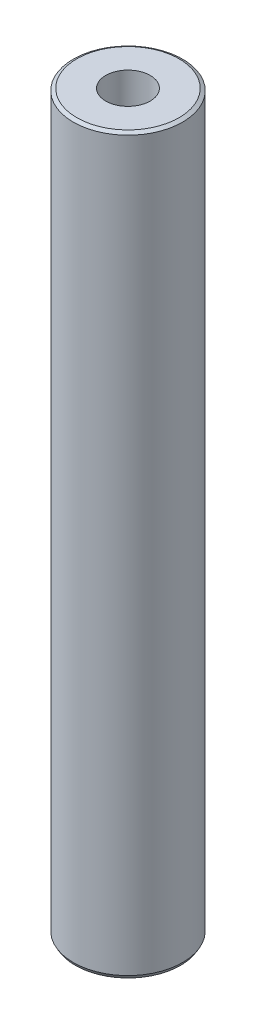
ISO-10303-21;
HEADER;
FILE_DESCRIPTION(('STEP AP214'),'2;1');
FILE_NAME('part.step','',(''),(''),'','','');
FILE_SCHEMA(('AUTOMOTIVE_DESIGN { 1 0 10303 214 1 1 1 1 }'));
ENDSEC;
DATA;
#1=APPLICATION_CONTEXT('core data for automotive mechanical design processes');
#2=APPLICATION_PROTOCOL_DEFINITION('international standard','automotive_design',2000,#1);
#3=PRODUCT_CONTEXT('',#1,'mechanical');
#4=PRODUCT('Part','Part','',(#3));
#5=PRODUCT_RELATED_PRODUCT_CATEGORY('part','',(#4));
#6=PRODUCT_DEFINITION_FORMATION('','',#4);
#7=PRODUCT_DEFINITION_CONTEXT('part definition',#1,'design');
#8=PRODUCT_DEFINITION('design','',#6,#7);
#9=PRODUCT_DEFINITION_SHAPE('','',#8);
#10=(LENGTH_UNIT() NAMED_UNIT(*) SI_UNIT(.MILLI.,.METRE.));
#11=(NAMED_UNIT(*) PLANE_ANGLE_UNIT() SI_UNIT($,.RADIAN.));
#12=(NAMED_UNIT(*) SI_UNIT($,.STERADIAN.) SOLID_ANGLE_UNIT());
#13=UNCERTAINTY_MEASURE_WITH_UNIT(LENGTH_MEASURE(1.E-05),#10,'distance_accuracy_value','');
#14=(GEOMETRIC_REPRESENTATION_CONTEXT(3) GLOBAL_UNCERTAINTY_ASSIGNED_CONTEXT((#13)) GLOBAL_UNIT_ASSIGNED_CONTEXT((#10,
#11,#12)) REPRESENTATION_CONTEXT('',''));
#15=CARTESIAN_POINT('',(0.,0.,0.));
#16=DIRECTION('',(0.,0.,1.));
#17=DIRECTION('',(1.,0.,0.));
#18=AXIS2_PLACEMENT_3D('',#15,#16,#17);
#19=CARTESIAN_POINT('',(0.,436.254081007214,0.));
#20=DIRECTION('',(0.,-1.,0.));
#21=DIRECTION('',(0.,0.,-1.));
#22=AXIS2_PLACEMENT_3D('',#19,#20,#21);
#23=CYLINDRICAL_SURFACE('',#22,32.5);
#24=CARTESIAN_POINT('',(0.,435.037041553271,0.));
#25=DIRECTION('',(0.,1.,0.));
#26=DIRECTION('',(0.,0.,1.));
#27=AXIS2_PLACEMENT_3D('',#24,#25,#26);
#28=CIRCLE('',#27,32.5);
#29=CARTESIAN_POINT('',(0.,435.037041553271,32.5));
#30=VERTEX_POINT('',#29);
#31=EDGE_CURVE('E50',#30,#30,#28,.F.);
#32=ORIENTED_EDGE('',*,*,#31,.T.);
#33=EDGE_LOOP('',(#32));
#34=FACE_BOUND('',#33,.T.);
#35=CARTESIAN_POINT('',(0.,2.10797416904568,0.));
#36=DIRECTION('',(0.,1.,0.));
#37=DIRECTION('',(0.,0.,1.));
#38=AXIS2_PLACEMENT_3D('',#35,#36,#37);
#39=CIRCLE('',#38,32.5);
#40=CARTESIAN_POINT('',(0.,2.10797416904568,32.5));
#41=VERTEX_POINT('',#40);
#42=EDGE_CURVE('E51',#41,#41,#39,.T.);
#43=ORIENTED_EDGE('',*,*,#42,.T.);
#44=EDGE_LOOP('',(#43));
#45=FACE_BOUND('',#44,.T.);
#46=ADVANCED_FACE('F39',(#34,#45),#23,.T.);
#47=CARTESIAN_POINT('',(0.,436.254081007214,0.));
#48=DIRECTION('',(0.,1.,0.));
#49=DIRECTION('',(0.,0.,1.));
#50=AXIS2_PLACEMENT_3D('',#47,#48,#49);
#51=PLANE('',#50);
#52=CARTESIAN_POINT('',(0.,436.254081007214,0.));
#53=DIRECTION('',(0.,1.,0.));
#54=DIRECTION('',(0.,0.,1.));
#55=AXIS2_PLACEMENT_3D('',#52,#53,#54);
#56=CIRCLE('',#55,30.3920258309543);
#57=CARTESIAN_POINT('',(0.,436.254081007214,30.3920258309543));
#58=VERTEX_POINT('',#57);
#59=EDGE_CURVE('E54',#58,#58,#56,.T.);
#60=ORIENTED_EDGE('',*,*,#59,.T.);
#61=EDGE_LOOP('',(#60));
#62=FACE_BOUND('',#61,.T.);
#63=CARTESIAN_POINT('',(0.,436.254081007214,0.));
#64=DIRECTION('',(0.,1.,0.));
#65=DIRECTION('',(0.,0.,1.));
#66=AXIS2_PLACEMENT_3D('',#63,#64,#65);
#67=CIRCLE('',#66,13.2352410158458);
#68=CARTESIAN_POINT('',(0.,436.254081007214,13.2352410158458));
#69=VERTEX_POINT('',#68);
#70=EDGE_CURVE('E58',#69,#69,#67,.T.);
#71=ORIENTED_EDGE('',*,*,#70,.F.);
#72=EDGE_LOOP('',(#71));
#73=FACE_BOUND('',#72,.T.);
#74=ADVANCED_FACE('F69',(#62,#73),#51,.T.);
#75=CARTESIAN_POINT('',(0.,0.,0.));
#76=DIRECTION('',(0.,1.,0.));
#77=DIRECTION('',(0.,0.,1.));
#78=AXIS2_PLACEMENT_3D('',#75,#76,#77);
#79=PLANE('',#78);
#80=CARTESIAN_POINT('',(0.,0.,0.));
#81=DIRECTION('',(0.,1.,0.));
#82=DIRECTION('',(0.,0.,1.));
#83=AXIS2_PLACEMENT_3D('',#80,#81,#82);
#84=CIRCLE('',#83,31.2829605460567);
#85=CARTESIAN_POINT('',(0.,0.,31.2829605460567));
#86=VERTEX_POINT('',#85);
#87=EDGE_CURVE('E10',#86,#86,#84,.F.);
#88=ORIENTED_EDGE('',*,*,#87,.T.);
#89=EDGE_LOOP('',(#88));
#90=FACE_BOUND('',#89,.T.);
#91=CARTESIAN_POINT('',(0.,0.,0.));
#92=DIRECTION('',(0.,1.,0.));
#93=DIRECTION('',(0.,0.,1.));
#94=AXIS2_PLACEMENT_3D('',#91,#92,#93);
#95=CIRCLE('',#94,13.2352410158458);
#96=CARTESIAN_POINT('',(0.,0.,13.2352410158458));
#97=VERTEX_POINT('',#96);
#98=EDGE_CURVE('E63',#97,#97,#95,.T.);
#99=ORIENTED_EDGE('',*,*,#98,.T.);
#100=EDGE_LOOP('',(#99));
#101=FACE_BOUND('',#100,.T.);
#102=ADVANCED_FACE('F75',(#90,#101),#79,.F.);
#103=CARTESIAN_POINT('',(0.,436.254081007214,0.));
#104=DIRECTION('',(0.,-1.,0.));
#105=DIRECTION('',(0.,0.,-1.));
#106=AXIS2_PLACEMENT_3D('',#103,#104,#105);
#107=CYLINDRICAL_SURFACE('',#106,13.2352410158458);
#108=ORIENTED_EDGE('',*,*,#70,.T.);
#109=EDGE_LOOP('',(#108));
#110=FACE_BOUND('',#109,.T.);
#111=ORIENTED_EDGE('',*,*,#98,.F.);
#112=EDGE_LOOP('',(#111));
#113=FACE_BOUND('',#112,.T.);
#114=ADVANCED_FACE('F70',(#110,#113),#107,.F.);
#115=CARTESIAN_POINT('',(0.,436.254081007214,0.));
#116=DIRECTION('',(0.,-1.,0.));
#117=DIRECTION('',(0.,0.,-1.));
#118=AXIS2_PLACEMENT_3D('',#115,#116,#117);
#119=CONICAL_SURFACE('',#118,30.3920258309543,1.04719755119658);
#120=ORIENTED_EDGE('',*,*,#31,.F.);
#121=EDGE_LOOP('',(#120));
#122=FACE_BOUND('',#121,.T.);
#123=ORIENTED_EDGE('',*,*,#59,.F.);
#124=EDGE_LOOP('',(#123));
#125=FACE_BOUND('',#124,.T.);
#126=ADVANCED_FACE('F81',(#122,#125),#119,.T.);
#127=CARTESIAN_POINT('',(0.,2.10797416904568,0.));
#128=DIRECTION('',(0.,1.,0.));
#129=DIRECTION('',(0.,0.,1.));
#130=AXIS2_PLACEMENT_3D('',#127,#128,#129);
#131=CONICAL_SURFACE('',#130,32.5,0.5235987755983);
#132=ORIENTED_EDGE('',*,*,#87,.F.);
#133=EDGE_LOOP('',(#132));
#134=FACE_BOUND('',#133,.T.);
#135=ORIENTED_EDGE('',*,*,#42,.F.);
#136=EDGE_LOOP('',(#135));
#137=FACE_BOUND('',#136,.T.);
#138=ADVANCED_FACE('F45',(#134,#137),#131,.T.);
#139=CLOSED_SHELL('',(#46,#74,#102,#114,#126,#138));
#140=MANIFOLD_SOLID_BREP('B2',#139);
#141=ADVANCED_BREP_SHAPE_REPRESENTATION('',(#18,#140),#14);
#142=SHAPE_DEFINITION_REPRESENTATION(#9,#141);
ENDSEC;
END-ISO-10303-21;
